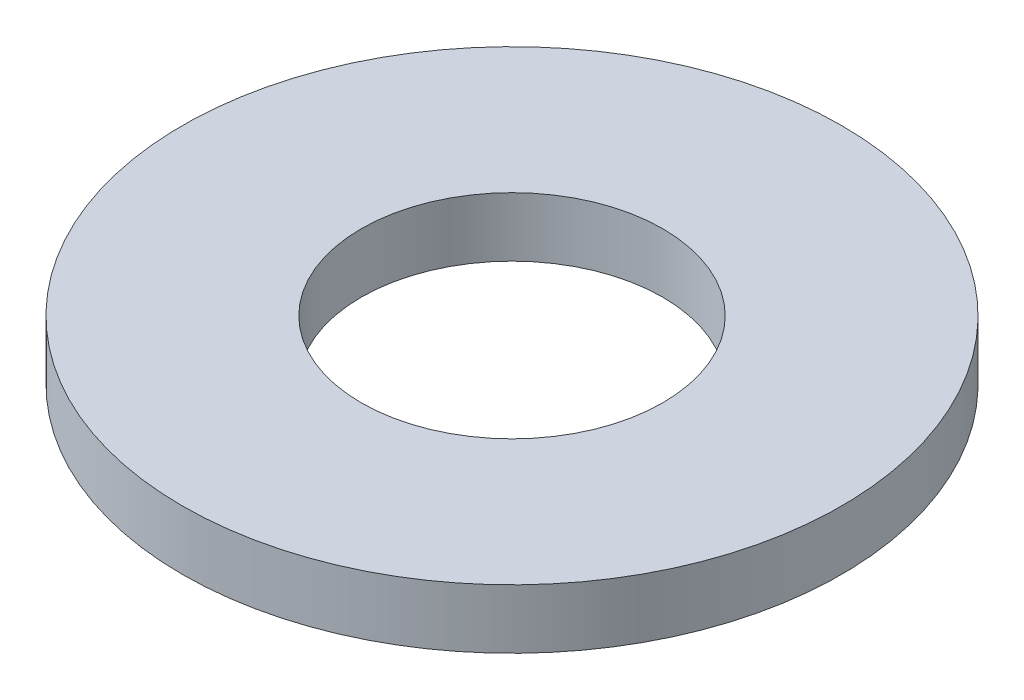
ISO-10303-21;
HEADER;
FILE_DESCRIPTION(('STEP AP214'),'2;1');
FILE_NAME('part.step','',(''),(''),'','','');
FILE_SCHEMA(('AUTOMOTIVE_DESIGN { 1 0 10303 214 1 1 1 1 }'));
ENDSEC;
DATA;
#1=APPLICATION_CONTEXT('core data for automotive mechanical design processes');
#2=APPLICATION_PROTOCOL_DEFINITION('international standard','automotive_design',2000,#1);
#3=PRODUCT_CONTEXT('',#1,'mechanical');
#4=PRODUCT('Part','Part','',(#3));
#5=PRODUCT_RELATED_PRODUCT_CATEGORY('part','',(#4));
#6=PRODUCT_DEFINITION_FORMATION('','',#4);
#7=PRODUCT_DEFINITION_CONTEXT('part definition',#1,'design');
#8=PRODUCT_DEFINITION('design','',#6,#7);
#9=PRODUCT_DEFINITION_SHAPE('','',#8);
#10=(LENGTH_UNIT() NAMED_UNIT(*) SI_UNIT(.MILLI.,.METRE.));
#11=(NAMED_UNIT(*) PLANE_ANGLE_UNIT() SI_UNIT($,.RADIAN.));
#12=(NAMED_UNIT(*) SI_UNIT($,.STERADIAN.) SOLID_ANGLE_UNIT());
#13=UNCERTAINTY_MEASURE_WITH_UNIT(LENGTH_MEASURE(1.E-05),#10,'distance_accuracy_value','');
#14=(GEOMETRIC_REPRESENTATION_CONTEXT(3) GLOBAL_UNCERTAINTY_ASSIGNED_CONTEXT((#13)) GLOBAL_UNIT_ASSIGNED_CONTEXT((#10,
#11,#12)) REPRESENTATION_CONTEXT('',''));
#15=CARTESIAN_POINT('',(0.,0.,0.));
#16=DIRECTION('',(0.,0.,1.));
#17=DIRECTION('',(1.,0.,0.));
#18=AXIS2_PLACEMENT_3D('',#15,#16,#17);
#19=CARTESIAN_POINT('',(0.,0.9144,0.));
#20=DIRECTION('',(0.,1.,0.));
#21=DIRECTION('',(0.,0.,1.));
#22=AXIS2_PLACEMENT_3D('',#19,#20,#21);
#23=PLANE('',#22);
#24=CARTESIAN_POINT('',(0.,0.9144,0.));
#25=DIRECTION('',(0.,-1.,0.));
#26=DIRECTION('',(0.,0.,-1.));
#27=AXIS2_PLACEMENT_3D('',#24,#25,#26);
#28=CIRCLE('',#27,5.08);
#29=CARTESIAN_POINT('',(0.,0.9144,-5.08));
#30=VERTEX_POINT('',#29);
#31=EDGE_CURVE('E27',#30,#30,#28,.T.);
#32=ORIENTED_EDGE('',*,*,#31,.F.);
#33=EDGE_LOOP('',(#32));
#34=FACE_BOUND('',#33,.T.);
#35=CARTESIAN_POINT('',(0.,0.9144,0.));
#36=DIRECTION('',(0.,-1.,0.));
#37=DIRECTION('',(0.,0.,-1.));
#38=AXIS2_PLACEMENT_3D('',#35,#36,#37);
#39=CIRCLE('',#38,2.3241);
#40=CARTESIAN_POINT('',(0.,0.9144,-2.3241));
#41=VERTEX_POINT('',#40);
#42=EDGE_CURVE('E18',#41,#41,#39,.T.);
#43=ORIENTED_EDGE('',*,*,#42,.T.);
#44=EDGE_LOOP('',(#43));
#45=FACE_BOUND('',#44,.T.);
#46=ADVANCED_FACE('F15',(#34,#45),#23,.T.);
#47=CARTESIAN_POINT('',(0.,0.9144,0.));
#48=DIRECTION('',(0.,-1.,0.));
#49=DIRECTION('',(0.,0.,-1.));
#50=AXIS2_PLACEMENT_3D('',#47,#48,#49);
#51=CYLINDRICAL_SURFACE('',#50,2.3241);
#52=CARTESIAN_POINT('',(0.,0.,0.));
#53=DIRECTION('',(0.,-1.,0.));
#54=DIRECTION('',(0.,0.,-1.));
#55=AXIS2_PLACEMENT_3D('',#52,#53,#54);
#56=CIRCLE('',#55,2.3241);
#57=CARTESIAN_POINT('',(0.,0.,-2.3241));
#58=VERTEX_POINT('',#57);
#59=EDGE_CURVE('E22',#58,#58,#56,.T.);
#60=ORIENTED_EDGE('',*,*,#59,.T.);
#61=EDGE_LOOP('',(#60));
#62=FACE_BOUND('',#61,.T.);
#63=ORIENTED_EDGE('',*,*,#42,.F.);
#64=EDGE_LOOP('',(#63));
#65=FACE_BOUND('',#64,.T.);
#66=ADVANCED_FACE('F36',(#62,#65),#51,.F.);
#67=CARTESIAN_POINT('',(0.,0.9144,0.));
#68=DIRECTION('',(0.,-1.,0.));
#69=DIRECTION('',(0.,0.,-1.));
#70=AXIS2_PLACEMENT_3D('',#67,#68,#69);
#71=CYLINDRICAL_SURFACE('',#70,5.08);
#72=ORIENTED_EDGE('',*,*,#31,.T.);
#73=EDGE_LOOP('',(#72));
#74=FACE_BOUND('',#73,.T.);
#75=CARTESIAN_POINT('',(0.,0.,0.));
#76=DIRECTION('',(0.,-1.,0.));
#77=DIRECTION('',(0.,0.,-1.));
#78=AXIS2_PLACEMENT_3D('',#75,#76,#77);
#79=CIRCLE('',#78,5.08);
#80=CARTESIAN_POINT('',(0.,0.,-5.08));
#81=VERTEX_POINT('',#80);
#82=EDGE_CURVE('E10',#81,#81,#79,.F.);
#83=ORIENTED_EDGE('',*,*,#82,.T.);
#84=EDGE_LOOP('',(#83));
#85=FACE_BOUND('',#84,.T.);
#86=ADVANCED_FACE('F38',(#74,#85),#71,.T.);
#87=CARTESIAN_POINT('',(0.,0.,0.));
#88=DIRECTION('',(0.,1.,0.));
#89=DIRECTION('',(0.,0.,1.));
#90=AXIS2_PLACEMENT_3D('',#87,#88,#89);
#91=PLANE('',#90);
#92=ORIENTED_EDGE('',*,*,#82,.F.);
#93=EDGE_LOOP('',(#92));
#94=FACE_BOUND('',#93,.T.);
#95=ORIENTED_EDGE('',*,*,#59,.F.);
#96=EDGE_LOOP('',(#95));
#97=FACE_BOUND('',#96,.T.);
#98=ADVANCED_FACE('F45',(#94,#97),#91,.F.);
#99=CLOSED_SHELL('',(#46,#66,#86,#98));
#100=MANIFOLD_SOLID_BREP('B1',#99);
#101=ADVANCED_BREP_SHAPE_REPRESENTATION('',(#18,#100),#14);
#102=SHAPE_DEFINITION_REPRESENTATION(#9,#101);
ENDSEC;
END-ISO-10303-21;
